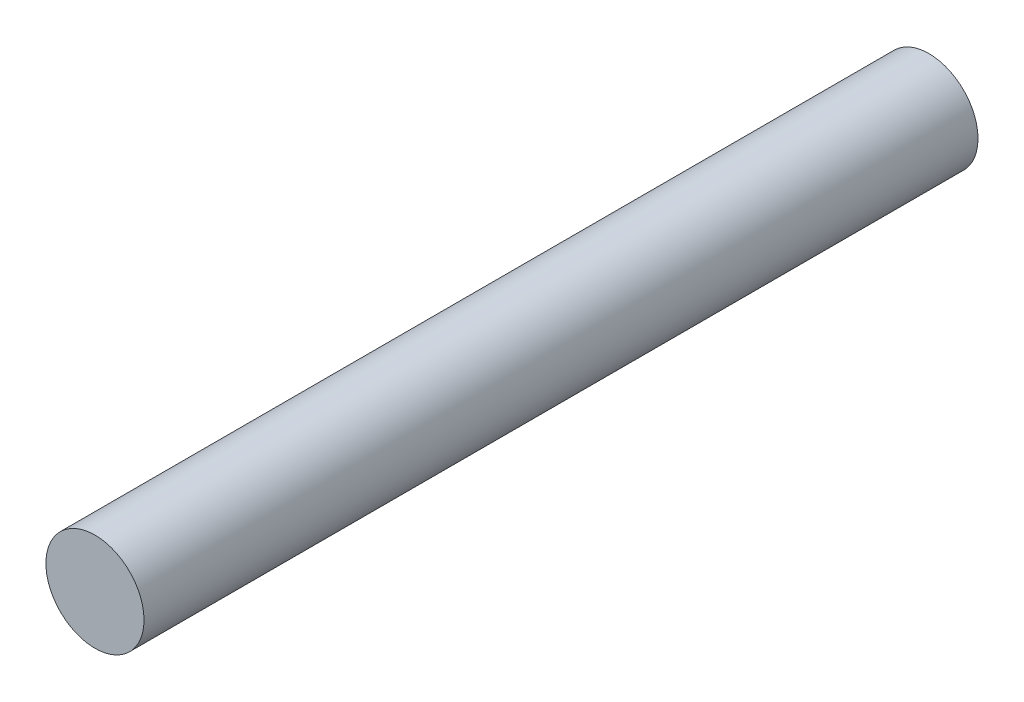
ISO-10303-21;
HEADER;
FILE_DESCRIPTION(('STEP AP214'),'2;1');
FILE_NAME('part.step','',(''),(''),'','','');
FILE_SCHEMA(('AUTOMOTIVE_DESIGN { 1 0 10303 214 1 1 1 1 }'));
ENDSEC;
DATA;
#1=APPLICATION_CONTEXT('core data for automotive mechanical design processes');
#2=APPLICATION_PROTOCOL_DEFINITION('international standard','automotive_design',2000,#1);
#3=PRODUCT_CONTEXT('',#1,'mechanical');
#4=PRODUCT('Part','Part','',(#3));
#5=PRODUCT_RELATED_PRODUCT_CATEGORY('part','',(#4));
#6=PRODUCT_DEFINITION_FORMATION('','',#4);
#7=PRODUCT_DEFINITION_CONTEXT('part definition',#1,'design');
#8=PRODUCT_DEFINITION('design','',#6,#7);
#9=PRODUCT_DEFINITION_SHAPE('','',#8);
#10=(LENGTH_UNIT() NAMED_UNIT(*) SI_UNIT(.MILLI.,.METRE.));
#11=(NAMED_UNIT(*) PLANE_ANGLE_UNIT() SI_UNIT($,.RADIAN.));
#12=(NAMED_UNIT(*) SI_UNIT($,.STERADIAN.) SOLID_ANGLE_UNIT());
#13=UNCERTAINTY_MEASURE_WITH_UNIT(LENGTH_MEASURE(1.E-05),#10,'distance_accuracy_value','');
#14=(GEOMETRIC_REPRESENTATION_CONTEXT(3) GLOBAL_UNCERTAINTY_ASSIGNED_CONTEXT((#13)) GLOBAL_UNIT_ASSIGNED_CONTEXT((#10,
#11,#12)) REPRESENTATION_CONTEXT('',''));
#15=CARTESIAN_POINT('',(0.,0.,0.));
#16=DIRECTION('',(0.,0.,1.));
#17=DIRECTION('',(1.,0.,0.));
#18=AXIS2_PLACEMENT_3D('',#15,#16,#17);
#19=CARTESIAN_POINT('',(0.,0.,34.));
#20=DIRECTION('',(0.,0.,-1.));
#21=DIRECTION('',(-1.,0.,0.));
#22=AXIS2_PLACEMENT_3D('',#19,#20,#21);
#23=CYLINDRICAL_SURFACE('',#22,2.);
#24=CARTESIAN_POINT('',(0.,0.,34.));
#25=DIRECTION('',(0.,0.,1.));
#26=DIRECTION('',(1.,0.,0.));
#27=AXIS2_PLACEMENT_3D('',#24,#25,#26);
#28=CIRCLE('',#27,2.);
#29=CARTESIAN_POINT('',(2.,0.,34.));
#30=VERTEX_POINT('',#29);
#31=EDGE_CURVE('E10',#30,#30,#28,.T.);
#32=ORIENTED_EDGE('',*,*,#31,.F.);
#33=EDGE_LOOP('',(#32));
#34=FACE_BOUND('',#33,.T.);
#35=CARTESIAN_POINT('',(0.,0.,0.));
#36=DIRECTION('',(0.,0.,1.));
#37=DIRECTION('',(1.,0.,0.));
#38=AXIS2_PLACEMENT_3D('',#35,#36,#37);
#39=CIRCLE('',#38,2.);
#40=CARTESIAN_POINT('',(2.,0.,0.));
#41=VERTEX_POINT('',#40);
#42=EDGE_CURVE('E37',#41,#41,#39,.T.);
#43=ORIENTED_EDGE('',*,*,#42,.T.);
#44=EDGE_LOOP('',(#43));
#45=FACE_BOUND('',#44,.T.);
#46=ADVANCED_FACE('F34',(#34,#45),#23,.T.);
#47=CARTESIAN_POINT('',(0.,0.,34.));
#48=DIRECTION('',(0.,0.,1.));
#49=DIRECTION('',(1.,0.,0.));
#50=AXIS2_PLACEMENT_3D('',#47,#48,#49);
#51=PLANE('',#50);
#52=ORIENTED_EDGE('',*,*,#31,.T.);
#53=EDGE_LOOP('',(#52));
#54=FACE_BOUND('',#53,.T.);
#55=ADVANCED_FACE('F49',(#54),#51,.T.);
#56=CARTESIAN_POINT('',(0.,0.,0.));
#57=DIRECTION('',(0.,0.,1.));
#58=DIRECTION('',(1.,0.,0.));
#59=AXIS2_PLACEMENT_3D('',#56,#57,#58);
#60=PLANE('',#59);
#61=ORIENTED_EDGE('',*,*,#42,.F.);
#62=EDGE_LOOP('',(#61));
#63=FACE_BOUND('',#62,.T.);
#64=ADVANCED_FACE('F47',(#63),#60,.F.);
#65=CLOSED_SHELL('',(#46,#55,#64));
#66=MANIFOLD_SOLID_BREP('B2',#65);
#67=ADVANCED_BREP_SHAPE_REPRESENTATION('',(#18,#66),#14);
#68=SHAPE_DEFINITION_REPRESENTATION(#9,#67);
ENDSEC;
END-ISO-10303-21;
